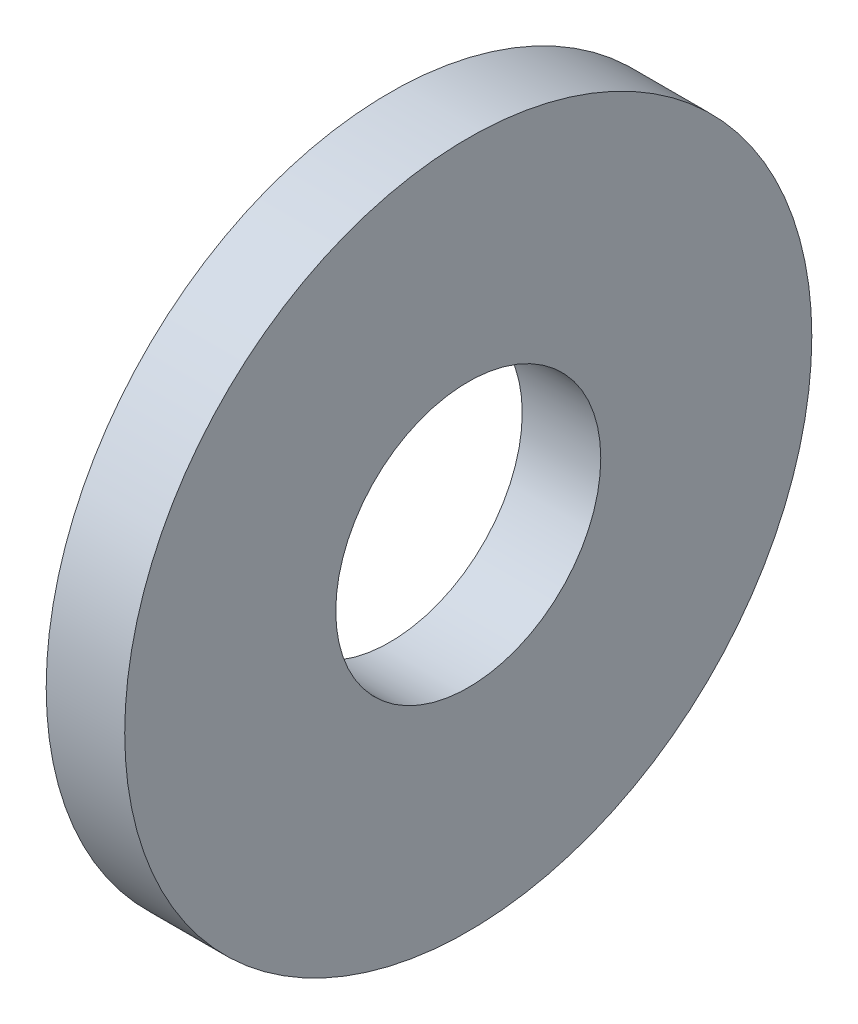
ISO-10303-21;
HEADER;
FILE_DESCRIPTION(('STEP AP214'),'2;1');
FILE_NAME('part.step','',(''),(''),'','','');
FILE_SCHEMA(('AUTOMOTIVE_DESIGN { 1 0 10303 214 1 1 1 1 }'));
ENDSEC;
DATA;
#1=APPLICATION_CONTEXT('core data for automotive mechanical design processes');
#2=APPLICATION_PROTOCOL_DEFINITION('international standard','automotive_design',2000,#1);
#3=PRODUCT_CONTEXT('',#1,'mechanical');
#4=PRODUCT('Part','Part','',(#3));
#5=PRODUCT_RELATED_PRODUCT_CATEGORY('part','',(#4));
#6=PRODUCT_DEFINITION_FORMATION('','',#4);
#7=PRODUCT_DEFINITION_CONTEXT('part definition',#1,'design');
#8=PRODUCT_DEFINITION('design','',#6,#7);
#9=PRODUCT_DEFINITION_SHAPE('','',#8);
#10=(LENGTH_UNIT() NAMED_UNIT(*) SI_UNIT(.MILLI.,.METRE.));
#11=(NAMED_UNIT(*) PLANE_ANGLE_UNIT() SI_UNIT($,.RADIAN.));
#12=(NAMED_UNIT(*) SI_UNIT($,.STERADIAN.) SOLID_ANGLE_UNIT());
#13=UNCERTAINTY_MEASURE_WITH_UNIT(LENGTH_MEASURE(1.E-05),#10,'distance_accuracy_value','');
#14=(GEOMETRIC_REPRESENTATION_CONTEXT(3) GLOBAL_UNCERTAINTY_ASSIGNED_CONTEXT((#13)) GLOBAL_UNIT_ASSIGNED_CONTEXT((#10,
#11,#12)) REPRESENTATION_CONTEXT('',''));
#15=CARTESIAN_POINT('',(0.,0.,0.));
#16=DIRECTION('',(0.,0.,1.));
#17=DIRECTION('',(1.,0.,0.));
#18=AXIS2_PLACEMENT_3D('',#15,#16,#17);
#19=CARTESIAN_POINT('',(1.6,0.,0.));
#20=DIRECTION('',(1.,0.,0.));
#21=DIRECTION('',(0.,0.,-1.));
#22=AXIS2_PLACEMENT_3D('',#19,#20,#21);
#23=PLANE('',#22);
#24=CARTESIAN_POINT('',(1.6,0.,0.));
#25=DIRECTION('',(1.,0.,0.));
#26=DIRECTION('',(0.,0.,-1.));
#27=AXIS2_PLACEMENT_3D('',#24,#25,#26);
#28=CIRCLE('',#27,7.);
#29=CARTESIAN_POINT('',(1.6,0.,-7.));
#30=VERTEX_POINT('',#29);
#31=EDGE_CURVE('E10',#30,#30,#28,.T.);
#32=ORIENTED_EDGE('',*,*,#31,.T.);
#33=EDGE_LOOP('',(#32));
#34=FACE_BOUND('',#33,.T.);
#35=CARTESIAN_POINT('',(1.6,0.,0.));
#36=DIRECTION('',(1.,0.,0.));
#37=DIRECTION('',(0.,0.,-1.));
#38=AXIS2_PLACEMENT_3D('',#35,#36,#37);
#39=CIRCLE('',#38,2.7);
#40=CARTESIAN_POINT('',(1.6,0.,-2.7));
#41=VERTEX_POINT('',#40);
#42=EDGE_CURVE('E41',#41,#41,#39,.T.);
#43=ORIENTED_EDGE('',*,*,#42,.F.);
#44=EDGE_LOOP('',(#43));
#45=FACE_BOUND('',#44,.T.);
#46=ADVANCED_FACE('F30',(#34,#45),#23,.T.);
#47=CARTESIAN_POINT('',(0.,0.,0.));
#48=DIRECTION('',(1.,0.,0.));
#49=DIRECTION('',(0.,0.,-1.));
#50=AXIS2_PLACEMENT_3D('',#47,#48,#49);
#51=PLANE('',#50);
#52=CARTESIAN_POINT('',(0.,0.,0.));
#53=DIRECTION('',(1.,0.,0.));
#54=DIRECTION('',(0.,0.,-1.));
#55=AXIS2_PLACEMENT_3D('',#52,#53,#54);
#56=CIRCLE('',#55,7.);
#57=CARTESIAN_POINT('',(0.,0.,-7.));
#58=VERTEX_POINT('',#57);
#59=EDGE_CURVE('E34',#58,#58,#56,.T.);
#60=ORIENTED_EDGE('',*,*,#59,.F.);
#61=EDGE_LOOP('',(#60));
#62=FACE_BOUND('',#61,.T.);
#63=CARTESIAN_POINT('',(0.,0.,0.));
#64=DIRECTION('',(1.,0.,0.));
#65=DIRECTION('',(0.,0.,-1.));
#66=AXIS2_PLACEMENT_3D('',#63,#64,#65);
#67=CIRCLE('',#66,2.7);
#68=CARTESIAN_POINT('',(0.,0.,-2.7));
#69=VERTEX_POINT('',#68);
#70=EDGE_CURVE('E43',#69,#69,#67,.T.);
#71=ORIENTED_EDGE('',*,*,#70,.T.);
#72=EDGE_LOOP('',(#71));
#73=FACE_BOUND('',#72,.T.);
#74=ADVANCED_FACE('F53',(#62,#73),#51,.F.);
#75=CARTESIAN_POINT('',(1.6,0.,0.));
#76=DIRECTION('',(-1.,0.,0.));
#77=DIRECTION('',(0.,0.,1.));
#78=AXIS2_PLACEMENT_3D('',#75,#76,#77);
#79=CYLINDRICAL_SURFACE('',#78,7.);
#80=ORIENTED_EDGE('',*,*,#31,.F.);
#81=EDGE_LOOP('',(#80));
#82=FACE_BOUND('',#81,.T.);
#83=ORIENTED_EDGE('',*,*,#59,.T.);
#84=EDGE_LOOP('',(#83));
#85=FACE_BOUND('',#84,.T.);
#86=ADVANCED_FACE('F32',(#82,#85),#79,.T.);
#87=CARTESIAN_POINT('',(1.6,0.,0.));
#88=DIRECTION('',(-1.,0.,0.));
#89=DIRECTION('',(0.,0.,1.));
#90=AXIS2_PLACEMENT_3D('',#87,#88,#89);
#91=CYLINDRICAL_SURFACE('',#90,2.7);
#92=ORIENTED_EDGE('',*,*,#42,.T.);
#93=EDGE_LOOP('',(#92));
#94=FACE_BOUND('',#93,.T.);
#95=ORIENTED_EDGE('',*,*,#70,.F.);
#96=EDGE_LOOP('',(#95));
#97=FACE_BOUND('',#96,.T.);
#98=ADVANCED_FACE('F49',(#94,#97),#91,.F.);
#99=CLOSED_SHELL('',(#46,#74,#86,#98));
#100=MANIFOLD_SOLID_BREP('B2',#99);
#101=ADVANCED_BREP_SHAPE_REPRESENTATION('',(#18,#100),#14);
#102=SHAPE_DEFINITION_REPRESENTATION(#9,#101);
ENDSEC;
END-ISO-10303-21;
